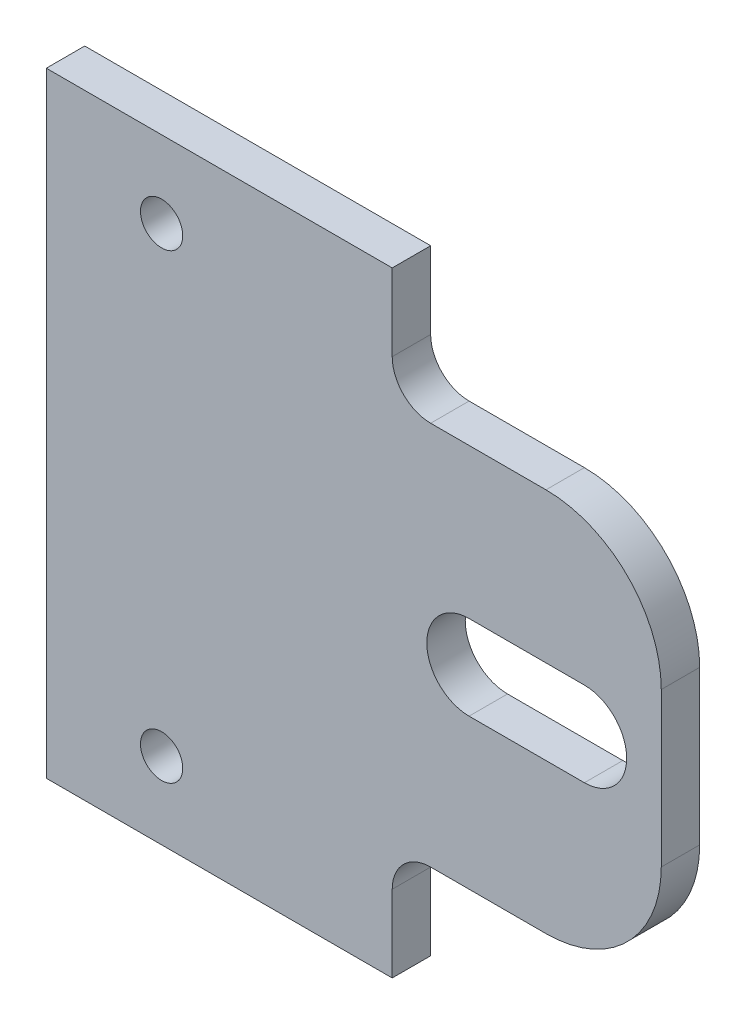
ISO-10303-21;
HEADER;
FILE_DESCRIPTION(('STEP AP214'),'2;1');
FILE_NAME('part.step','',(''),(''),'','','');
FILE_SCHEMA(('AUTOMOTIVE_DESIGN { 1 0 10303 214 1 1 1 1 }'));
ENDSEC;
DATA;
#1=APPLICATION_CONTEXT('core data for automotive mechanical design processes');
#2=APPLICATION_PROTOCOL_DEFINITION('international standard','automotive_design',2000,#1);
#3=PRODUCT_CONTEXT('',#1,'mechanical');
#4=PRODUCT('Part','Part','',(#3));
#5=PRODUCT_RELATED_PRODUCT_CATEGORY('part','',(#4));
#6=PRODUCT_DEFINITION_FORMATION('','',#4);
#7=PRODUCT_DEFINITION_CONTEXT('part definition',#1,'design');
#8=PRODUCT_DEFINITION('design','',#6,#7);
#9=PRODUCT_DEFINITION_SHAPE('','',#8);
#10=(LENGTH_UNIT() NAMED_UNIT(*) SI_UNIT(.MILLI.,.METRE.));
#11=(NAMED_UNIT(*) PLANE_ANGLE_UNIT() SI_UNIT($,.RADIAN.));
#12=(NAMED_UNIT(*) SI_UNIT($,.STERADIAN.) SOLID_ANGLE_UNIT());
#13=UNCERTAINTY_MEASURE_WITH_UNIT(LENGTH_MEASURE(1.E-05),#10,'distance_accuracy_value','');
#14=(GEOMETRIC_REPRESENTATION_CONTEXT(3) GLOBAL_UNCERTAINTY_ASSIGNED_CONTEXT((#13)) GLOBAL_UNIT_ASSIGNED_CONTEXT((#10,
#11,#12)) REPRESENTATION_CONTEXT('',''));
#15=CARTESIAN_POINT('',(0.,0.,0.));
#16=DIRECTION('',(0.,0.,1.));
#17=DIRECTION('',(1.,0.,0.));
#18=AXIS2_PLACEMENT_3D('',#15,#16,#17);
#19=CARTESIAN_POINT('',(0.,0.,5.));
#20=DIRECTION('',(0.,1.,0.));
#21=DIRECTION('',(-1.,0.,0.));
#22=AXIS2_PLACEMENT_3D('',#19,#20,#21);
#23=PLANE('',#22);
#24=DIRECTION('',(1.,0.,0.));
#25=VECTOR('',#24,1.);
#26=CARTESIAN_POINT('',(0.,0.,0.));
#27=LINE('',#26,#25);
#28=CARTESIAN_POINT('',(0.,0.,0.));
#29=VERTEX_POINT('',#28);
#30=CARTESIAN_POINT('',(45.,0.,0.));
#31=VERTEX_POINT('',#30);
#32=EDGE_CURVE('E225',#29,#31,#27,.T.);
#33=ORIENTED_EDGE('',*,*,#32,.T.);
#34=DIRECTION('',(0.,0.,-1.));
#35=VECTOR('',#34,1.);
#36=CARTESIAN_POINT('',(45.,0.,5.));
#37=LINE('',#36,#35);
#38=CARTESIAN_POINT('',(45.,0.,5.));
#39=VERTEX_POINT('',#38);
#40=EDGE_CURVE('E251',#39,#31,#37,.T.);
#41=ORIENTED_EDGE('',*,*,#40,.F.);
#42=DIRECTION('',(1.,0.,0.));
#43=VECTOR('',#42,1.);
#44=CARTESIAN_POINT('',(0.,0.,5.));
#45=LINE('',#44,#43);
#46=CARTESIAN_POINT('',(0.,0.,5.));
#47=VERTEX_POINT('',#46);
#48=EDGE_CURVE('E188',#47,#39,#45,.T.);
#49=ORIENTED_EDGE('',*,*,#48,.F.);
#50=DIRECTION('',(0.,0.,-1.));
#51=VECTOR('',#50,1.);
#52=CARTESIAN_POINT('',(0.,0.,5.));
#53=LINE('',#52,#51);
#54=EDGE_CURVE('E161',#47,#29,#53,.T.);
#55=ORIENTED_EDGE('',*,*,#54,.T.);
#56=EDGE_LOOP('',(#33,#41,#49,#55));
#57=FACE_BOUND('',#56,.T.);
#58=ADVANCED_FACE('F36',(#57),#23,.F.);
#59=CARTESIAN_POINT('',(45.,0.,5.));
#60=DIRECTION('',(-1.,0.,0.));
#61=DIRECTION('',(0.,0.,1.));
#62=AXIS2_PLACEMENT_3D('',#59,#60,#61);
#63=PLANE('',#62);
#64=DIRECTION('',(0.,1.,0.));
#65=VECTOR('',#64,1.);
#66=CARTESIAN_POINT('',(45.,0.,0.));
#67=LINE('',#66,#65);
#68=CARTESIAN_POINT('',(45.,9.99999999999999,0.));
#69=VERTEX_POINT('',#68);
#70=EDGE_CURVE('E228',#31,#69,#67,.T.);
#71=ORIENTED_EDGE('',*,*,#70,.T.);
#72=DIRECTION('',(0.,0.,-1.));
#73=VECTOR('',#72,1.);
#74=CARTESIAN_POINT('',(45.,9.99999999999999,5.));
#75=LINE('',#74,#73);
#76=CARTESIAN_POINT('',(45.,9.99999999999999,5.));
#77=VERTEX_POINT('',#76);
#78=EDGE_CURVE('E261',#69,#77,#75,.F.);
#79=ORIENTED_EDGE('',*,*,#78,.T.);
#80=DIRECTION('',(0.,1.,0.));
#81=VECTOR('',#80,1.);
#82=CARTESIAN_POINT('',(45.,0.,5.));
#83=LINE('',#82,#81);
#84=EDGE_CURVE('E191',#39,#77,#83,.T.);
#85=ORIENTED_EDGE('',*,*,#84,.F.);
#86=ORIENTED_EDGE('',*,*,#40,.T.);
#87=EDGE_LOOP('',(#71,#79,#85,#86));
#88=FACE_BOUND('',#87,.T.);
#89=ADVANCED_FACE('F309',(#88),#63,.F.);
#90=CARTESIAN_POINT('',(0.,15.,5.));
#91=DIRECTION('',(0.,-1.,0.));
#92=DIRECTION('',(1.,0.,0.));
#93=AXIS2_PLACEMENT_3D('',#90,#91,#92);
#94=PLANE('',#93);
#95=DIRECTION('',(-1.,0.,0.));
#96=VECTOR('',#95,1.);
#97=CARTESIAN_POINT('',(0.,15.,0.));
#98=LINE('',#97,#96);
#99=CARTESIAN_POINT('',(65.,15.,0.));
#100=VERTEX_POINT('',#99);
#101=CARTESIAN_POINT('',(50.,15.,0.));
#102=VERTEX_POINT('',#101);
#103=EDGE_CURVE('E231',#100,#102,#98,.T.);
#104=ORIENTED_EDGE('',*,*,#103,.F.);
#105=DIRECTION('',(0.,0.,-1.));
#106=VECTOR('',#105,1.);
#107=CARTESIAN_POINT('',(65.,15.,5.));
#108=LINE('',#107,#106);
#109=CARTESIAN_POINT('',(65.,15.,5.));
#110=VERTEX_POINT('',#109);
#111=EDGE_CURVE('E59',#100,#110,#108,.F.);
#112=ORIENTED_EDGE('',*,*,#111,.T.);
#113=DIRECTION('',(-1.,0.,0.));
#114=VECTOR('',#113,1.);
#115=CARTESIAN_POINT('',(0.,15.,5.));
#116=LINE('',#115,#114);
#117=CARTESIAN_POINT('',(50.,15.,5.));
#118=VERTEX_POINT('',#117);
#119=EDGE_CURVE('E194',#110,#118,#116,.T.);
#120=ORIENTED_EDGE('',*,*,#119,.T.);
#121=DIRECTION('',(0.,0.,-1.));
#122=VECTOR('',#121,1.);
#123=CARTESIAN_POINT('',(50.,15.,5.));
#124=LINE('',#123,#122);
#125=EDGE_CURVE('E254',#118,#102,#124,.T.);
#126=ORIENTED_EDGE('',*,*,#125,.T.);
#127=EDGE_LOOP('',(#104,#112,#120,#126));
#128=FACE_BOUND('',#127,.T.);
#129=ADVANCED_FACE('F301',(#128),#94,.T.);
#130=CARTESIAN_POINT('',(80.,0.,5.));
#131=DIRECTION('',(-1.,0.,0.));
#132=DIRECTION('',(0.,0.,1.));
#133=AXIS2_PLACEMENT_3D('',#130,#131,#132);
#134=PLANE('',#133);
#135=DIRECTION('',(0.,1.,0.));
#136=VECTOR('',#135,1.);
#137=CARTESIAN_POINT('',(80.,0.,5.));
#138=LINE('',#137,#136);
#139=CARTESIAN_POINT('',(80.,30.,5.));
#140=VERTEX_POINT('',#139);
#141=CARTESIAN_POINT('',(80.,50.,5.));
#142=VERTEX_POINT('',#141);
#143=EDGE_CURVE('E196',#140,#142,#138,.T.);
#144=ORIENTED_EDGE('',*,*,#143,.F.);
#145=DIRECTION('',(0.,0.,-1.));
#146=VECTOR('',#145,1.);
#147=CARTESIAN_POINT('',(80.,30.,0.));
#148=LINE('',#147,#146);
#149=CARTESIAN_POINT('',(80.,30.,0.));
#150=VERTEX_POINT('',#149);
#151=EDGE_CURVE('E281',#140,#150,#148,.T.);
#152=ORIENTED_EDGE('',*,*,#151,.T.);
#153=DIRECTION('',(0.,1.,0.));
#154=VECTOR('',#153,1.);
#155=CARTESIAN_POINT('',(80.,0.,0.));
#156=LINE('',#155,#154);
#157=CARTESIAN_POINT('',(80.,50.,0.));
#158=VERTEX_POINT('',#157);
#159=EDGE_CURVE('E233',#150,#158,#156,.T.);
#160=ORIENTED_EDGE('',*,*,#159,.T.);
#161=DIRECTION('',(0.,0.,-1.));
#162=VECTOR('',#161,1.);
#163=CARTESIAN_POINT('',(80.,50.,5.));
#164=LINE('',#163,#162);
#165=EDGE_CURVE('E279',#158,#142,#164,.F.);
#166=ORIENTED_EDGE('',*,*,#165,.T.);
#167=EDGE_LOOP('',(#144,#152,#160,#166));
#168=FACE_BOUND('',#167,.T.);
#169=ADVANCED_FACE('F294',(#168),#134,.F.);
#170=CARTESIAN_POINT('',(0.,65.,5.));
#171=DIRECTION('',(0.,-1.,0.));
#172=DIRECTION('',(0.,0.,-1.));
#173=AXIS2_PLACEMENT_3D('',#170,#171,#172);
#174=PLANE('',#173);
#175=DIRECTION('',(-1.,0.,0.));
#176=VECTOR('',#175,1.);
#177=CARTESIAN_POINT('',(0.,65.,5.));
#178=LINE('',#177,#176);
#179=CARTESIAN_POINT('',(65.,65.,5.));
#180=VERTEX_POINT('',#179);
#181=CARTESIAN_POINT('',(50.,65.,5.));
#182=VERTEX_POINT('',#181);
#183=EDGE_CURVE('E198',#180,#182,#178,.T.);
#184=ORIENTED_EDGE('',*,*,#183,.F.);
#185=DIRECTION('',(0.,0.,-1.));
#186=VECTOR('',#185,1.);
#187=CARTESIAN_POINT('',(65.,65.,5.));
#188=LINE('',#187,#186);
#189=CARTESIAN_POINT('',(65.,65.,0.));
#190=VERTEX_POINT('',#189);
#191=EDGE_CURVE('E11',#180,#190,#188,.T.);
#192=ORIENTED_EDGE('',*,*,#191,.T.);
#193=DIRECTION('',(-1.,0.,0.));
#194=VECTOR('',#193,1.);
#195=CARTESIAN_POINT('',(0.,65.,0.));
#196=LINE('',#195,#194);
#197=CARTESIAN_POINT('',(50.,65.,0.));
#198=VERTEX_POINT('',#197);
#199=EDGE_CURVE('E236',#190,#198,#196,.T.);
#200=ORIENTED_EDGE('',*,*,#199,.T.);
#201=DIRECTION('',(0.,0.,-1.));
#202=VECTOR('',#201,1.);
#203=CARTESIAN_POINT('',(50.,65.,5.));
#204=LINE('',#203,#202);
#205=EDGE_CURVE('E266',#198,#182,#204,.F.);
#206=ORIENTED_EDGE('',*,*,#205,.T.);
#207=EDGE_LOOP('',(#184,#192,#200,#206));
#208=FACE_BOUND('',#207,.T.);
#209=ADVANCED_FACE('F332',(#208),#174,.F.);
#210=CARTESIAN_POINT('',(45.,0.,5.));
#211=DIRECTION('',(1.,0.,0.));
#212=DIRECTION('',(0.,0.,-1.));
#213=AXIS2_PLACEMENT_3D('',#210,#211,#212);
#214=PLANE('',#213);
#215=DIRECTION('',(0.,-1.,0.));
#216=VECTOR('',#215,1.);
#217=CARTESIAN_POINT('',(45.,0.,5.));
#218=LINE('',#217,#216);
#219=CARTESIAN_POINT('',(45.,80.,5.));
#220=VERTEX_POINT('',#219);
#221=CARTESIAN_POINT('',(45.,70.,5.));
#222=VERTEX_POINT('',#221);
#223=EDGE_CURVE('E200',#220,#222,#218,.T.);
#224=ORIENTED_EDGE('',*,*,#223,.T.);
#225=DIRECTION('',(0.,0.,-1.));
#226=VECTOR('',#225,1.);
#227=CARTESIAN_POINT('',(45.,70.,5.));
#228=LINE('',#227,#226);
#229=CARTESIAN_POINT('',(45.,70.,0.));
#230=VERTEX_POINT('',#229);
#231=EDGE_CURVE('E263',#222,#230,#228,.T.);
#232=ORIENTED_EDGE('',*,*,#231,.T.);
#233=DIRECTION('',(0.,-1.,0.));
#234=VECTOR('',#233,1.);
#235=CARTESIAN_POINT('',(45.,0.,0.));
#236=LINE('',#235,#234);
#237=CARTESIAN_POINT('',(45.,80.,0.));
#238=VERTEX_POINT('',#237);
#239=EDGE_CURVE('E238',#238,#230,#236,.T.);
#240=ORIENTED_EDGE('',*,*,#239,.F.);
#241=DIRECTION('',(0.,0.,-1.));
#242=VECTOR('',#241,1.);
#243=CARTESIAN_POINT('',(45.,80.,5.));
#244=LINE('',#243,#242);
#245=EDGE_CURVE('E249',#220,#238,#244,.T.);
#246=ORIENTED_EDGE('',*,*,#245,.F.);
#247=EDGE_LOOP('',(#224,#232,#240,#246));
#248=FACE_BOUND('',#247,.T.);
#249=ADVANCED_FACE('F325',(#248),#214,.T.);
#250=CARTESIAN_POINT('',(0.,80.,5.));
#251=DIRECTION('',(0.,1.,0.));
#252=DIRECTION('',(0.,0.,1.));
#253=AXIS2_PLACEMENT_3D('',#250,#251,#252);
#254=PLANE('',#253);
#255=DIRECTION('',(1.,0.,0.));
#256=VECTOR('',#255,1.);
#257=CARTESIAN_POINT('',(0.,80.,0.));
#258=LINE('',#257,#256);
#259=CARTESIAN_POINT('',(0.,80.,0.));
#260=VERTEX_POINT('',#259);
#261=EDGE_CURVE('E241',#260,#238,#258,.T.);
#262=ORIENTED_EDGE('',*,*,#261,.F.);
#263=DIRECTION('',(0.,0.,-1.));
#264=VECTOR('',#263,1.);
#265=CARTESIAN_POINT('',(0.,80.,5.));
#266=LINE('',#265,#264);
#267=CARTESIAN_POINT('',(0.,80.,5.));
#268=VERTEX_POINT('',#267);
#269=EDGE_CURVE('E247',#268,#260,#266,.T.);
#270=ORIENTED_EDGE('',*,*,#269,.F.);
#271=DIRECTION('',(1.,0.,0.));
#272=VECTOR('',#271,1.);
#273=CARTESIAN_POINT('',(0.,80.,5.));
#274=LINE('',#273,#272);
#275=EDGE_CURVE('E203',#268,#220,#274,.T.);
#276=ORIENTED_EDGE('',*,*,#275,.T.);
#277=ORIENTED_EDGE('',*,*,#245,.T.);
#278=EDGE_LOOP('',(#262,#270,#276,#277));
#279=FACE_BOUND('',#278,.T.);
#280=ADVANCED_FACE('F320',(#279),#254,.T.);
#281=CARTESIAN_POINT('',(55.,40.,5.));
#282=DIRECTION('',(0.,0.,-1.));
#283=DIRECTION('',(-1.,0.,0.));
#284=AXIS2_PLACEMENT_3D('',#281,#282,#283);
#285=CYLINDRICAL_SURFACE('',#284,5.49999999999999);
#286=CARTESIAN_POINT('',(55.,40.,0.));
#287=DIRECTION('',(0.,0.,1.));
#288=DIRECTION('',(1.,0.,0.));
#289=AXIS2_PLACEMENT_3D('',#286,#287,#288);
#290=CIRCLE('',#289,5.49999999999999);
#291=CARTESIAN_POINT('',(55.,45.5,0.));
#292=VERTEX_POINT('',#291);
#293=CARTESIAN_POINT('',(55.,34.5,0.));
#294=VERTEX_POINT('',#293);
#295=EDGE_CURVE('E156',#292,#294,#290,.T.);
#296=ORIENTED_EDGE('',*,*,#295,.F.);
#297=DIRECTION('',(0.,0.,-1.));
#298=VECTOR('',#297,1.);
#299=CARTESIAN_POINT('',(55.,45.5,5.));
#300=LINE('',#299,#298);
#301=CARTESIAN_POINT('',(55.,45.5,5.));
#302=VERTEX_POINT('',#301);
#303=EDGE_CURVE('E151',#302,#292,#300,.T.);
#304=ORIENTED_EDGE('',*,*,#303,.F.);
#305=CARTESIAN_POINT('',(55.,40.,5.));
#306=DIRECTION('',(0.,0.,1.));
#307=DIRECTION('',(1.,0.,0.));
#308=AXIS2_PLACEMENT_3D('',#305,#306,#307);
#309=CIRCLE('',#308,5.49999999999999);
#310=CARTESIAN_POINT('',(55.,34.5,5.));
#311=VERTEX_POINT('',#310);
#312=EDGE_CURVE('E154',#302,#311,#309,.T.);
#313=ORIENTED_EDGE('',*,*,#312,.T.);
#314=DIRECTION('',(0.,0.,-1.));
#315=VECTOR('',#314,1.);
#316=CARTESIAN_POINT('',(55.,34.5,5.));
#317=LINE('',#316,#315);
#318=EDGE_CURVE('E209',#311,#294,#317,.T.);
#319=ORIENTED_EDGE('',*,*,#318,.T.);
#320=EDGE_LOOP('',(#296,#304,#313,#319));
#321=FACE_BOUND('',#320,.T.);
#322=ADVANCED_FACE('F153',(#321),#285,.F.);
#323=CARTESIAN_POINT('',(0.,45.4999999999999,5.));
#324=DIRECTION('',(0.,-1.,0.));
#325=DIRECTION('',(1.,0.,0.));
#326=AXIS2_PLACEMENT_3D('',#323,#324,#325);
#327=PLANE('',#326);
#328=DIRECTION('',(-1.,0.,0.));
#329=VECTOR('',#328,1.);
#330=CARTESIAN_POINT('',(0.,45.4999999999999,0.));
#331=LINE('',#330,#329);
#332=CARTESIAN_POINT('',(70.,45.5,0.));
#333=VERTEX_POINT('',#332);
#334=EDGE_CURVE('E211',#333,#292,#331,.T.);
#335=ORIENTED_EDGE('',*,*,#334,.F.);
#336=DIRECTION('',(0.,0.,-1.));
#337=VECTOR('',#336,1.);
#338=CARTESIAN_POINT('',(70.,45.5,5.));
#339=LINE('',#338,#337);
#340=CARTESIAN_POINT('',(70.,45.5,5.));
#341=VERTEX_POINT('',#340);
#342=EDGE_CURVE('E162',#341,#333,#339,.T.);
#343=ORIENTED_EDGE('',*,*,#342,.F.);
#344=DIRECTION('',(-1.,0.,0.));
#345=VECTOR('',#344,1.);
#346=CARTESIAN_POINT('',(0.,45.4999999999999,5.));
#347=LINE('',#346,#345);
#348=EDGE_CURVE('E169',#341,#302,#347,.T.);
#349=ORIENTED_EDGE('',*,*,#348,.T.);
#350=ORIENTED_EDGE('',*,*,#303,.T.);
#351=EDGE_LOOP('',(#335,#343,#349,#350));
#352=FACE_BOUND('',#351,.T.);
#353=ADVANCED_FACE('F176',(#352),#327,.T.);
#354=CARTESIAN_POINT('',(70.,40.,5.));
#355=DIRECTION('',(0.,0.,-1.));
#356=DIRECTION('',(-1.,0.,0.));
#357=AXIS2_PLACEMENT_3D('',#354,#355,#356);
#358=CYLINDRICAL_SURFACE('',#357,5.5);
#359=CARTESIAN_POINT('',(70.,40.,0.));
#360=DIRECTION('',(0.,0.,1.));
#361=DIRECTION('',(1.,0.,0.));
#362=AXIS2_PLACEMENT_3D('',#359,#360,#361);
#363=CIRCLE('',#362,5.5);
#364=CARTESIAN_POINT('',(70.,34.5,0.));
#365=VERTEX_POINT('',#364);
#366=EDGE_CURVE('E213',#365,#333,#363,.T.);
#367=ORIENTED_EDGE('',*,*,#366,.F.);
#368=DIRECTION('',(0.,0.,-1.));
#369=VECTOR('',#368,1.);
#370=CARTESIAN_POINT('',(70.,34.5,5.));
#371=LINE('',#370,#369);
#372=CARTESIAN_POINT('',(70.,34.5,5.));
#373=VERTEX_POINT('',#372);
#374=EDGE_CURVE('E256',#373,#365,#371,.T.);
#375=ORIENTED_EDGE('',*,*,#374,.F.);
#376=CARTESIAN_POINT('',(70.,40.,5.));
#377=DIRECTION('',(0.,0.,1.));
#378=DIRECTION('',(1.,0.,0.));
#379=AXIS2_PLACEMENT_3D('',#376,#377,#378);
#380=CIRCLE('',#379,5.5);
#381=EDGE_CURVE('E177',#373,#341,#380,.T.);
#382=ORIENTED_EDGE('',*,*,#381,.T.);
#383=ORIENTED_EDGE('',*,*,#342,.T.);
#384=EDGE_LOOP('',(#367,#375,#382,#383));
#385=FACE_BOUND('',#384,.T.);
#386=ADVANCED_FACE('F351',(#385),#358,.F.);
#387=CARTESIAN_POINT('',(15.,70.,5.));
#388=DIRECTION('',(0.,0.,-1.));
#389=DIRECTION('',(-1.,0.,0.));
#390=AXIS2_PLACEMENT_3D('',#387,#388,#389);
#391=CYLINDRICAL_SURFACE('',#390,2.75);
#392=CARTESIAN_POINT('',(15.,70.,5.));
#393=DIRECTION('',(0.,0.,1.));
#394=DIRECTION('',(1.,0.,0.));
#395=AXIS2_PLACEMENT_3D('',#392,#393,#394);
#396=CIRCLE('',#395,2.75);
#397=CARTESIAN_POINT('',(17.75,70.,5.));
#398=VERTEX_POINT('',#397);
#399=EDGE_CURVE('E185',#398,#398,#396,.T.);
#400=ORIENTED_EDGE('',*,*,#399,.T.);
#401=EDGE_LOOP('',(#400));
#402=FACE_BOUND('',#401,.T.);
#403=CARTESIAN_POINT('',(15.,70.,0.));
#404=DIRECTION('',(0.,0.,1.));
#405=DIRECTION('',(1.,0.,0.));
#406=AXIS2_PLACEMENT_3D('',#403,#404,#405);
#407=CIRCLE('',#406,2.75);
#408=CARTESIAN_POINT('',(17.75,70.,0.));
#409=VERTEX_POINT('',#408);
#410=EDGE_CURVE('E222',#409,#409,#407,.T.);
#411=ORIENTED_EDGE('',*,*,#410,.F.);
#412=EDGE_LOOP('',(#411));
#413=FACE_BOUND('',#412,.T.);
#414=ADVANCED_FACE('F347',(#402,#413),#391,.F.);
#415=CARTESIAN_POINT('',(15.,10.,5.));
#416=DIRECTION('',(0.,0.,-1.));
#417=DIRECTION('',(-1.,0.,0.));
#418=AXIS2_PLACEMENT_3D('',#415,#416,#417);
#419=CYLINDRICAL_SURFACE('',#418,2.75);
#420=CARTESIAN_POINT('',(15.,10.,5.));
#421=DIRECTION('',(0.,0.,1.));
#422=DIRECTION('',(1.,0.,0.));
#423=AXIS2_PLACEMENT_3D('',#420,#421,#422);
#424=CIRCLE('',#423,2.75);
#425=CARTESIAN_POINT('',(17.75,10.,5.));
#426=VERTEX_POINT('',#425);
#427=EDGE_CURVE('E182',#426,#426,#424,.T.);
#428=ORIENTED_EDGE('',*,*,#427,.T.);
#429=EDGE_LOOP('',(#428));
#430=FACE_BOUND('',#429,.T.);
#431=CARTESIAN_POINT('',(15.,10.,0.));
#432=DIRECTION('',(0.,0.,1.));
#433=DIRECTION('',(1.,0.,0.));
#434=AXIS2_PLACEMENT_3D('',#431,#432,#433);
#435=CIRCLE('',#434,2.75);
#436=CARTESIAN_POINT('',(17.75,10.,0.));
#437=VERTEX_POINT('',#436);
#438=EDGE_CURVE('E219',#437,#437,#435,.T.);
#439=ORIENTED_EDGE('',*,*,#438,.F.);
#440=EDGE_LOOP('',(#439));
#441=FACE_BOUND('',#440,.T.);
#442=ADVANCED_FACE('F350',(#430,#441),#419,.F.);
#443=CARTESIAN_POINT('',(0.,34.5,5.));
#444=DIRECTION('',(0.,-1.,0.));
#445=DIRECTION('',(1.,0.,0.));
#446=AXIS2_PLACEMENT_3D('',#443,#444,#445);
#447=PLANE('',#446);
#448=DIRECTION('',(-1.,0.,0.));
#449=VECTOR('',#448,1.);
#450=CARTESIAN_POINT('',(0.,34.5,0.));
#451=LINE('',#450,#449);
#452=EDGE_CURVE('E216',#365,#294,#451,.T.);
#453=ORIENTED_EDGE('',*,*,#452,.T.);
#454=ORIENTED_EDGE('',*,*,#318,.F.);
#455=DIRECTION('',(-1.,0.,0.));
#456=VECTOR('',#455,1.);
#457=CARTESIAN_POINT('',(0.,34.5,5.));
#458=LINE('',#457,#456);
#459=EDGE_CURVE('E172',#373,#311,#458,.T.);
#460=ORIENTED_EDGE('',*,*,#459,.F.);
#461=ORIENTED_EDGE('',*,*,#374,.T.);
#462=EDGE_LOOP('',(#453,#454,#460,#461));
#463=FACE_BOUND('',#462,.T.);
#464=ADVANCED_FACE('F355',(#463),#447,.F.);
#465=CARTESIAN_POINT('',(0.,0.,5.));
#466=DIRECTION('',(-1.,0.,0.));
#467=DIRECTION('',(0.,0.,1.));
#468=AXIS2_PLACEMENT_3D('',#465,#466,#467);
#469=PLANE('',#468);
#470=DIRECTION('',(0.,1.,0.));
#471=VECTOR('',#470,1.);
#472=CARTESIAN_POINT('',(0.,0.,0.));
#473=LINE('',#472,#471);
#474=EDGE_CURVE('E174',#29,#260,#473,.T.);
#475=ORIENTED_EDGE('',*,*,#474,.F.);
#476=ORIENTED_EDGE('',*,*,#54,.F.);
#477=DIRECTION('',(0.,1.,0.));
#478=VECTOR('',#477,1.);
#479=CARTESIAN_POINT('',(0.,0.,5.));
#480=LINE('',#479,#478);
#481=EDGE_CURVE('E206',#47,#268,#480,.T.);
#482=ORIENTED_EDGE('',*,*,#481,.T.);
#483=ORIENTED_EDGE('',*,*,#269,.T.);
#484=EDGE_LOOP('',(#475,#476,#482,#483));
#485=FACE_BOUND('',#484,.T.);
#486=ADVANCED_FACE('F315',(#485),#469,.T.);
#487=CARTESIAN_POINT('',(0.,0.,5.));
#488=DIRECTION('',(0.,0.,1.));
#489=DIRECTION('',(1.,0.,0.));
#490=AXIS2_PLACEMENT_3D('',#487,#488,#489);
#491=PLANE('',#490);
#492=ORIENTED_EDGE('',*,*,#312,.F.);
#493=ORIENTED_EDGE('',*,*,#348,.F.);
#494=ORIENTED_EDGE('',*,*,#381,.F.);
#495=ORIENTED_EDGE('',*,*,#459,.T.);
#496=EDGE_LOOP('',(#492,#493,#494,#495));
#497=FACE_BOUND('',#496,.T.);
#498=ORIENTED_EDGE('',*,*,#427,.F.);
#499=EDGE_LOOP('',(#498));
#500=FACE_BOUND('',#499,.T.);
#501=ORIENTED_EDGE('',*,*,#399,.F.);
#502=EDGE_LOOP('',(#501));
#503=FACE_BOUND('',#502,.T.);
#504=ORIENTED_EDGE('',*,*,#119,.F.);
#505=CARTESIAN_POINT('',(65.,30.,5.));
#506=DIRECTION('',(0.,0.,1.));
#507=DIRECTION('',(1.,0.,0.));
#508=AXIS2_PLACEMENT_3D('',#505,#506,#507);
#509=CIRCLE('',#508,15.);
#510=EDGE_CURVE('E44',#110,#140,#509,.T.);
#511=ORIENTED_EDGE('',*,*,#510,.T.);
#512=ORIENTED_EDGE('',*,*,#143,.T.);
#513=CARTESIAN_POINT('',(65.,50.,5.));
#514=DIRECTION('',(0.,0.,1.));
#515=DIRECTION('',(1.,0.,0.));
#516=AXIS2_PLACEMENT_3D('',#513,#514,#515);
#517=CIRCLE('',#516,15.);
#518=EDGE_CURVE('E51',#142,#180,#517,.T.);
#519=ORIENTED_EDGE('',*,*,#518,.T.);
#520=ORIENTED_EDGE('',*,*,#183,.T.);
#521=CARTESIAN_POINT('',(50.,70.,5.));
#522=DIRECTION('',(0.,0.,1.));
#523=DIRECTION('',(1.,0.,0.));
#524=AXIS2_PLACEMENT_3D('',#521,#522,#523);
#525=CIRCLE('',#524,5.);
#526=EDGE_CURVE('E277',#182,#222,#525,.F.);
#527=ORIENTED_EDGE('',*,*,#526,.T.);
#528=ORIENTED_EDGE('',*,*,#223,.F.);
#529=ORIENTED_EDGE('',*,*,#275,.F.);
#530=ORIENTED_EDGE('',*,*,#481,.F.);
#531=ORIENTED_EDGE('',*,*,#48,.T.);
#532=ORIENTED_EDGE('',*,*,#84,.T.);
#533=CARTESIAN_POINT('',(50.,9.99999999999999,5.));
#534=DIRECTION('',(0.,0.,1.));
#535=DIRECTION('',(1.,0.,0.));
#536=AXIS2_PLACEMENT_3D('',#533,#534,#535);
#537=CIRCLE('',#536,5.);
#538=EDGE_CURVE('E271',#77,#118,#537,.F.);
#539=ORIENTED_EDGE('',*,*,#538,.T.);
#540=EDGE_LOOP('',(#504,#511,#512,#519,#520,#527,#528,#529,#530,#531,#532,#539));
#541=FACE_BOUND('',#540,.T.);
#542=ADVANCED_FACE('F166',(#497,#500,#503,#541),#491,.T.);
#543=CARTESIAN_POINT('',(0.,0.,0.));
#544=DIRECTION('',(0.,0.,1.));
#545=DIRECTION('',(1.,0.,0.));
#546=AXIS2_PLACEMENT_3D('',#543,#544,#545);
#547=PLANE('',#546);
#548=ORIENTED_EDGE('',*,*,#295,.T.);
#549=ORIENTED_EDGE('',*,*,#452,.F.);
#550=ORIENTED_EDGE('',*,*,#366,.T.);
#551=ORIENTED_EDGE('',*,*,#334,.T.);
#552=EDGE_LOOP('',(#548,#549,#550,#551));
#553=FACE_BOUND('',#552,.T.);
#554=ORIENTED_EDGE('',*,*,#438,.T.);
#555=EDGE_LOOP('',(#554));
#556=FACE_BOUND('',#555,.T.);
#557=ORIENTED_EDGE('',*,*,#410,.T.);
#558=EDGE_LOOP('',(#557));
#559=FACE_BOUND('',#558,.T.);
#560=ORIENTED_EDGE('',*,*,#159,.F.);
#561=CARTESIAN_POINT('',(65.,30.,0.));
#562=DIRECTION('',(0.,0.,1.));
#563=DIRECTION('',(1.,0.,0.));
#564=AXIS2_PLACEMENT_3D('',#561,#562,#563);
#565=CIRCLE('',#564,15.);
#566=EDGE_CURVE('E286',#150,#100,#565,.F.);
#567=ORIENTED_EDGE('',*,*,#566,.T.);
#568=ORIENTED_EDGE('',*,*,#103,.T.);
#569=CARTESIAN_POINT('',(50.,9.99999999999999,0.));
#570=DIRECTION('',(0.,0.,1.));
#571=DIRECTION('',(1.,0.,0.));
#572=AXIS2_PLACEMENT_3D('',#569,#570,#571);
#573=CIRCLE('',#572,5.);
#574=EDGE_CURVE('E269',#102,#69,#573,.T.);
#575=ORIENTED_EDGE('',*,*,#574,.T.);
#576=ORIENTED_EDGE('',*,*,#70,.F.);
#577=ORIENTED_EDGE('',*,*,#32,.F.);
#578=ORIENTED_EDGE('',*,*,#474,.T.);
#579=ORIENTED_EDGE('',*,*,#261,.T.);
#580=ORIENTED_EDGE('',*,*,#239,.T.);
#581=CARTESIAN_POINT('',(50.,70.,0.));
#582=DIRECTION('',(0.,0.,1.));
#583=DIRECTION('',(1.,0.,0.));
#584=AXIS2_PLACEMENT_3D('',#581,#582,#583);
#585=CIRCLE('',#584,5.);
#586=EDGE_CURVE('E274',#230,#198,#585,.T.);
#587=ORIENTED_EDGE('',*,*,#586,.T.);
#588=ORIENTED_EDGE('',*,*,#199,.F.);
#589=CARTESIAN_POINT('',(65.,50.,0.));
#590=DIRECTION('',(0.,0.,1.));
#591=DIRECTION('',(1.,0.,0.));
#592=AXIS2_PLACEMENT_3D('',#589,#590,#591);
#593=CIRCLE('',#592,15.);
#594=EDGE_CURVE('E284',#190,#158,#593,.F.);
#595=ORIENTED_EDGE('',*,*,#594,.T.);
#596=EDGE_LOOP('',(#560,#567,#568,#575,#576,#577,#578,#579,#580,#587,#588,#595));
#597=FACE_BOUND('',#596,.T.);
#598=ADVANCED_FACE('F299',(#553,#556,#559,#597),#547,.F.);
#599=CARTESIAN_POINT('',(50.,9.99999999999999,5.));
#600=DIRECTION('',(0.,0.,-1.));
#601=DIRECTION('',(-1.,0.,0.));
#602=AXIS2_PLACEMENT_3D('',#599,#600,#601);
#603=CYLINDRICAL_SURFACE('',#602,5.);
#604=ORIENTED_EDGE('',*,*,#538,.F.);
#605=ORIENTED_EDGE('',*,*,#78,.F.);
#606=ORIENTED_EDGE('',*,*,#574,.F.);
#607=ORIENTED_EDGE('',*,*,#125,.F.);
#608=EDGE_LOOP('',(#604,#605,#606,#607));
#609=FACE_BOUND('',#608,.T.);
#610=ADVANCED_FACE('F305',(#609),#603,.F.);
#611=CARTESIAN_POINT('',(50.,70.,5.));
#612=DIRECTION('',(0.,0.,-1.));
#613=DIRECTION('',(-1.,0.,0.));
#614=AXIS2_PLACEMENT_3D('',#611,#612,#613);
#615=CYLINDRICAL_SURFACE('',#614,5.);
#616=ORIENTED_EDGE('',*,*,#526,.F.);
#617=ORIENTED_EDGE('',*,*,#205,.F.);
#618=ORIENTED_EDGE('',*,*,#586,.F.);
#619=ORIENTED_EDGE('',*,*,#231,.F.);
#620=EDGE_LOOP('',(#616,#617,#618,#619));
#621=FACE_BOUND('',#620,.T.);
#622=ADVANCED_FACE('F330',(#621),#615,.F.);
#623=CARTESIAN_POINT('',(65.,30.,5.));
#624=DIRECTION('',(0.,0.,1.));
#625=DIRECTION('',(1.,0.,0.));
#626=AXIS2_PLACEMENT_3D('',#623,#624,#625);
#627=CYLINDRICAL_SURFACE('',#626,15.);
#628=ORIENTED_EDGE('',*,*,#510,.F.);
#629=ORIENTED_EDGE('',*,*,#111,.F.);
#630=ORIENTED_EDGE('',*,*,#566,.F.);
#631=ORIENTED_EDGE('',*,*,#151,.F.);
#632=EDGE_LOOP('',(#628,#629,#630,#631));
#633=FACE_BOUND('',#632,.T.);
#634=ADVANCED_FACE('F297',(#633),#627,.T.);
#635=CARTESIAN_POINT('',(65.,50.,5.));
#636=DIRECTION('',(0.,0.,-1.));
#637=DIRECTION('',(-1.,0.,0.));
#638=AXIS2_PLACEMENT_3D('',#635,#636,#637);
#639=CYLINDRICAL_SURFACE('',#638,15.);
#640=ORIENTED_EDGE('',*,*,#518,.F.);
#641=ORIENTED_EDGE('',*,*,#165,.F.);
#642=ORIENTED_EDGE('',*,*,#594,.F.);
#643=ORIENTED_EDGE('',*,*,#191,.F.);
#644=EDGE_LOOP('',(#640,#641,#642,#643));
#645=FACE_BOUND('',#644,.T.);
#646=ADVANCED_FACE('F38',(#645),#639,.T.);
#647=CLOSED_SHELL('',(#58,#89,#129,#169,#209,#249,#280,#322,#353,#386,#414,#442,#464,#486,#542,
#598,#610,#622,#634,#646));
#648=MANIFOLD_SOLID_BREP('B2',#647);
#649=ADVANCED_BREP_SHAPE_REPRESENTATION('',(#18,#648),#14);
#650=SHAPE_DEFINITION_REPRESENTATION(#9,#649);
ENDSEC;
END-ISO-10303-21;
